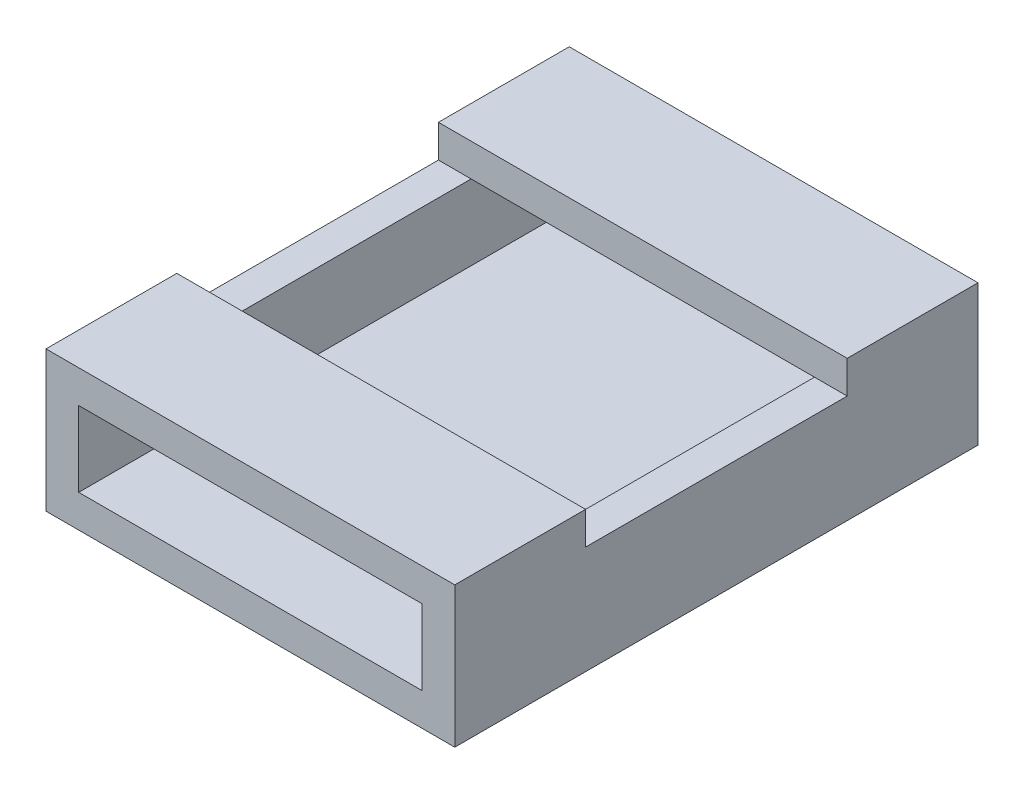
ISO-10303-21;
HEADER;
FILE_DESCRIPTION(('STEP AP214'),'2;1');
FILE_NAME('part.step','',(''),(''),'','','');
FILE_SCHEMA(('AUTOMOTIVE_DESIGN { 1 0 10303 214 1 1 1 1 }'));
ENDSEC;
DATA;
#1=APPLICATION_CONTEXT('core data for automotive mechanical design processes');
#2=APPLICATION_PROTOCOL_DEFINITION('international standard','automotive_design',2000,#1);
#3=PRODUCT_CONTEXT('',#1,'mechanical');
#4=PRODUCT('Part','Part','',(#3));
#5=PRODUCT_RELATED_PRODUCT_CATEGORY('part','',(#4));
#6=PRODUCT_DEFINITION_FORMATION('','',#4);
#7=PRODUCT_DEFINITION_CONTEXT('part definition',#1,'design');
#8=PRODUCT_DEFINITION('design','',#6,#7);
#9=PRODUCT_DEFINITION_SHAPE('','',#8);
#10=(LENGTH_UNIT() NAMED_UNIT(*) SI_UNIT(.MILLI.,.METRE.));
#11=(NAMED_UNIT(*) PLANE_ANGLE_UNIT() SI_UNIT($,.RADIAN.));
#12=(NAMED_UNIT(*) SI_UNIT($,.STERADIAN.) SOLID_ANGLE_UNIT());
#13=UNCERTAINTY_MEASURE_WITH_UNIT(LENGTH_MEASURE(1.E-05),#10,'distance_accuracy_value','');
#14=(GEOMETRIC_REPRESENTATION_CONTEXT(3) GLOBAL_UNCERTAINTY_ASSIGNED_CONTEXT((#13)) GLOBAL_UNIT_ASSIGNED_CONTEXT((#10,
#11,#12)) REPRESENTATION_CONTEXT('',''));
#15=CARTESIAN_POINT('',(0.,0.,0.));
#16=DIRECTION('',(0.,0.,1.));
#17=DIRECTION('',(1.,0.,0.));
#18=AXIS2_PLACEMENT_3D('',#15,#16,#17);
#19=CARTESIAN_POINT('',(0.,3.3,0.));
#20=DIRECTION('',(0.,1.,0.));
#21=DIRECTION('',(0.,0.,1.));
#22=AXIS2_PLACEMENT_3D('',#19,#20,#21);
#23=PLANE('',#22);
#24=DIRECTION('',(0.,0.,1.));
#25=VECTOR('',#24,1.);
#26=CARTESIAN_POINT('',(10.5,3.3,-8.));
#27=LINE('',#26,#25);
#28=CARTESIAN_POINT('',(10.5,3.3,-4.));
#29=VERTEX_POINT('',#28);
#30=CARTESIAN_POINT('',(10.5,3.3,4.));
#31=VERTEX_POINT('',#30);
#32=EDGE_CURVE('E219',#29,#31,#27,.T.);
#33=ORIENTED_EDGE('',*,*,#32,.T.);
#34=DIRECTION('',(-1.,0.,0.));
#35=VECTOR('',#34,1.);
#36=CARTESIAN_POINT('',(-0.999999999999998,3.3,4.));
#37=LINE('',#36,#35);
#38=CARTESIAN_POINT('',(11.5,3.3,4.));
#39=VERTEX_POINT('',#38);
#40=EDGE_CURVE('E168',#39,#31,#37,.T.);
#41=ORIENTED_EDGE('',*,*,#40,.F.);
#42=DIRECTION('',(0.,0.,-1.));
#43=VECTOR('',#42,1.);
#44=CARTESIAN_POINT('',(11.5,3.3,-8.));
#45=LINE('',#44,#43);
#46=CARTESIAN_POINT('',(11.5,3.3,-4.));
#47=VERTEX_POINT('',#46);
#48=EDGE_CURVE('E226',#39,#47,#45,.T.);
#49=ORIENTED_EDGE('',*,*,#48,.T.);
#50=DIRECTION('',(1.,0.,0.));
#51=VECTOR('',#50,1.);
#52=CARTESIAN_POINT('',(-0.999999999999999,3.3,-4.));
#53=LINE('',#52,#51);
#54=EDGE_CURVE('E185',#29,#47,#53,.T.);
#55=ORIENTED_EDGE('',*,*,#54,.F.);
#56=EDGE_LOOP('',(#33,#41,#49,#55));
#57=FACE_BOUND('',#56,.T.);
#58=ADVANCED_FACE('F37',(#57),#23,.T.);
#59=CARTESIAN_POINT('',(0.,3.3,0.));
#60=DIRECTION('',(0.,-1.,0.));
#61=DIRECTION('',(0.,0.,-1.));
#62=AXIS2_PLACEMENT_3D('',#59,#60,#61);
#63=PLANE('',#62);
#64=CARTESIAN_POINT('',(0.,3.3,4.));
#65=VERTEX_POINT('',#64);
#66=CARTESIAN_POINT('',(-0.999999999999999,3.3,4.));
#67=VERTEX_POINT('',#66);
#68=EDGE_CURVE('E62',#65,#67,#37,.T.);
#69=ORIENTED_EDGE('',*,*,#68,.F.);
#70=DIRECTION('',(0.,0.,-1.));
#71=VECTOR('',#70,1.);
#72=CARTESIAN_POINT('',(0.,3.3,-8.));
#73=LINE('',#72,#71);
#74=CARTESIAN_POINT('',(0.,3.3,-4.));
#75=VERTEX_POINT('',#74);
#76=EDGE_CURVE('E215',#65,#75,#73,.T.);
#77=ORIENTED_EDGE('',*,*,#76,.T.);
#78=CARTESIAN_POINT('',(-0.999999999999999,3.3,-4.));
#79=VERTEX_POINT('',#78);
#80=EDGE_CURVE('E199',#79,#75,#53,.T.);
#81=ORIENTED_EDGE('',*,*,#80,.F.);
#82=DIRECTION('',(0.,0.,1.));
#83=VECTOR('',#82,1.);
#84=CARTESIAN_POINT('',(-1.,3.3,-8.));
#85=LINE('',#84,#83);
#86=EDGE_CURVE('E214',#79,#67,#85,.T.);
#87=ORIENTED_EDGE('',*,*,#86,.T.);
#88=EDGE_LOOP('',(#69,#77,#81,#87));
#89=FACE_BOUND('',#88,.T.);
#90=ADVANCED_FACE('F266',(#89),#63,.F.);
#91=CARTESIAN_POINT('',(0.,1.,-8.));
#92=DIRECTION('',(0.,0.,-1.));
#93=DIRECTION('',(-1.,0.,0.));
#94=AXIS2_PLACEMENT_3D('',#91,#92,#93);
#95=PLANE('',#94);
#96=DIRECTION('',(0.,1.,0.));
#97=VECTOR('',#96,1.);
#98=CARTESIAN_POINT('',(10.5,0.,-8.));
#99=LINE('',#98,#97);
#100=CARTESIAN_POINT('',(10.5,1.,-8.));
#101=VERTEX_POINT('',#100);
#102=CARTESIAN_POINT('',(10.5,3.3,-8.));
#103=VERTEX_POINT('',#102);
#104=EDGE_CURVE('E232',#101,#103,#99,.T.);
#105=ORIENTED_EDGE('',*,*,#104,.T.);
#106=DIRECTION('',(-1.,0.,0.));
#107=VECTOR('',#106,1.);
#108=CARTESIAN_POINT('',(-1.,3.3,-8.));
#109=LINE('',#108,#107);
#110=CARTESIAN_POINT('',(0.,3.3,-8.));
#111=VERTEX_POINT('',#110);
#112=EDGE_CURVE('E190',#103,#111,#109,.T.);
#113=ORIENTED_EDGE('',*,*,#112,.T.);
#114=DIRECTION('',(0.,1.,0.));
#115=VECTOR('',#114,1.);
#116=CARTESIAN_POINT('',(0.,0.,-8.));
#117=LINE('',#116,#115);
#118=CARTESIAN_POINT('',(0.,1.,-8.));
#119=VERTEX_POINT('',#118);
#120=EDGE_CURVE('E218',#119,#111,#117,.T.);
#121=ORIENTED_EDGE('',*,*,#120,.F.);
#122=DIRECTION('',(1.,0.,0.));
#123=VECTOR('',#122,1.);
#124=CARTESIAN_POINT('',(0.,1.,-8.));
#125=LINE('',#124,#123);
#126=EDGE_CURVE('E243',#119,#101,#125,.T.);
#127=ORIENTED_EDGE('',*,*,#126,.T.);
#128=EDGE_LOOP('',(#105,#113,#121,#127));
#129=FACE_BOUND('',#128,.T.);
#130=DIRECTION('',(1.,0.,0.));
#131=VECTOR('',#130,1.);
#132=CARTESIAN_POINT('',(0.,0.,-8.));
#133=LINE('',#132,#131);
#134=CARTESIAN_POINT('',(-1.,0.,-8.));
#135=VERTEX_POINT('',#134);
#136=CARTESIAN_POINT('',(11.5,0.,-8.));
#137=VERTEX_POINT('',#136);
#138=EDGE_CURVE('E235',#135,#137,#133,.T.);
#139=ORIENTED_EDGE('',*,*,#138,.F.);
#140=DIRECTION('',(0.,1.,0.));
#141=VECTOR('',#140,1.);
#142=CARTESIAN_POINT('',(-1.,0.,-8.));
#143=LINE('',#142,#141);
#144=CARTESIAN_POINT('',(-1.,4.3,-8.));
#145=VERTEX_POINT('',#144);
#146=EDGE_CURVE('E152',#135,#145,#143,.T.);
#147=ORIENTED_EDGE('',*,*,#146,.T.);
#148=DIRECTION('',(-1.,0.,0.));
#149=VECTOR('',#148,1.);
#150=CARTESIAN_POINT('',(-1.,4.3,-8.));
#151=LINE('',#150,#149);
#152=CARTESIAN_POINT('',(11.5,4.3,-8.));
#153=VERTEX_POINT('',#152);
#154=EDGE_CURVE('E195',#153,#145,#151,.T.);
#155=ORIENTED_EDGE('',*,*,#154,.F.);
#156=DIRECTION('',(0.,1.,0.));
#157=VECTOR('',#156,1.);
#158=CARTESIAN_POINT('',(11.5,0.,-8.));
#159=LINE('',#158,#157);
#160=EDGE_CURVE('E236',#137,#153,#159,.T.);
#161=ORIENTED_EDGE('',*,*,#160,.F.);
#162=EDGE_LOOP('',(#139,#147,#155,#161));
#163=FACE_BOUND('',#162,.T.);
#164=ADVANCED_FACE('F39',(#129,#163),#95,.T.);
#165=CARTESIAN_POINT('',(0.,1.,8.));
#166=DIRECTION('',(0.,0.,-1.));
#167=DIRECTION('',(-1.,0.,0.));
#168=AXIS2_PLACEMENT_3D('',#165,#166,#167);
#169=PLANE('',#168);
#170=DIRECTION('',(0.,1.,0.));
#171=VECTOR('',#170,1.);
#172=CARTESIAN_POINT('',(11.5,0.,8.));
#173=LINE('',#172,#171);
#174=CARTESIAN_POINT('',(11.5,0.,8.));
#175=VERTEX_POINT('',#174);
#176=CARTESIAN_POINT('',(11.5,4.3,8.));
#177=VERTEX_POINT('',#176);
#178=EDGE_CURVE('E159',#175,#177,#173,.T.);
#179=ORIENTED_EDGE('',*,*,#178,.T.);
#180=DIRECTION('',(1.,0.,0.));
#181=VECTOR('',#180,1.);
#182=CARTESIAN_POINT('',(-0.999999999999998,4.3,8.));
#183=LINE('',#182,#181);
#184=CARTESIAN_POINT('',(-0.999999999999998,4.3,8.));
#185=VERTEX_POINT('',#184);
#186=EDGE_CURVE('E155',#185,#177,#183,.T.);
#187=ORIENTED_EDGE('',*,*,#186,.F.);
#188=DIRECTION('',(0.,1.,0.));
#189=VECTOR('',#188,1.);
#190=CARTESIAN_POINT('',(-0.999999999999998,0.,8.));
#191=LINE('',#190,#189);
#192=CARTESIAN_POINT('',(-0.999999999999998,0.,8.));
#193=VERTEX_POINT('',#192);
#194=EDGE_CURVE('E141',#193,#185,#191,.T.);
#195=ORIENTED_EDGE('',*,*,#194,.F.);
#196=DIRECTION('',(1.,0.,0.));
#197=VECTOR('',#196,1.);
#198=CARTESIAN_POINT('',(0.,0.,8.));
#199=LINE('',#198,#197);
#200=EDGE_CURVE('E41',#193,#175,#199,.T.);
#201=ORIENTED_EDGE('',*,*,#200,.T.);
#202=EDGE_LOOP('',(#179,#187,#195,#201));
#203=FACE_BOUND('',#202,.T.);
#204=DIRECTION('',(1.,0.,0.));
#205=VECTOR('',#204,1.);
#206=CARTESIAN_POINT('',(-0.999999999999998,3.3,8.));
#207=LINE('',#206,#205);
#208=CARTESIAN_POINT('',(0.,3.3,8.));
#209=VERTEX_POINT('',#208);
#210=CARTESIAN_POINT('',(10.5,3.3,8.));
#211=VERTEX_POINT('',#210);
#212=EDGE_CURVE('E177',#209,#211,#207,.T.);
#213=ORIENTED_EDGE('',*,*,#212,.T.);
#214=DIRECTION('',(0.,1.,0.));
#215=VECTOR('',#214,1.);
#216=CARTESIAN_POINT('',(10.5,0.,8.));
#217=LINE('',#216,#215);
#218=CARTESIAN_POINT('',(10.5,1.,8.));
#219=VERTEX_POINT('',#218);
#220=EDGE_CURVE('E231',#219,#211,#217,.T.);
#221=ORIENTED_EDGE('',*,*,#220,.F.);
#222=DIRECTION('',(1.,0.,0.));
#223=VECTOR('',#222,1.);
#224=CARTESIAN_POINT('',(0.,1.,8.));
#225=LINE('',#224,#223);
#226=CARTESIAN_POINT('',(0.,1.,8.));
#227=VERTEX_POINT('',#226);
#228=EDGE_CURVE('E11',#227,#219,#225,.T.);
#229=ORIENTED_EDGE('',*,*,#228,.F.);
#230=DIRECTION('',(0.,1.,0.));
#231=VECTOR('',#230,1.);
#232=CARTESIAN_POINT('',(0.,0.,8.));
#233=LINE('',#232,#231);
#234=EDGE_CURVE('E151',#227,#209,#233,.T.);
#235=ORIENTED_EDGE('',*,*,#234,.T.);
#236=EDGE_LOOP('',(#213,#221,#229,#235));
#237=FACE_BOUND('',#236,.T.);
#238=ADVANCED_FACE('F156',(#203,#237),#169,.F.);
#239=CARTESIAN_POINT('',(0.,1.,0.));
#240=DIRECTION('',(0.,1.,0.));
#241=DIRECTION('',(0.,0.,1.));
#242=AXIS2_PLACEMENT_3D('',#239,#240,#241);
#243=PLANE('',#242);
#244=DIRECTION('',(0.,0.,1.));
#245=VECTOR('',#244,1.);
#246=CARTESIAN_POINT('',(10.5,1.,0.));
#247=LINE('',#246,#245);
#248=EDGE_CURVE('E240',#101,#219,#247,.T.);
#249=ORIENTED_EDGE('',*,*,#248,.F.);
#250=ORIENTED_EDGE('',*,*,#126,.F.);
#251=DIRECTION('',(0.,0.,1.));
#252=VECTOR('',#251,1.);
#253=CARTESIAN_POINT('',(0.,1.,0.));
#254=LINE('',#253,#252);
#255=EDGE_CURVE('E46',#119,#227,#254,.T.);
#256=ORIENTED_EDGE('',*,*,#255,.T.);
#257=ORIENTED_EDGE('',*,*,#228,.T.);
#258=EDGE_LOOP('',(#249,#250,#256,#257));
#259=FACE_BOUND('',#258,.T.);
#260=ADVANCED_FACE('F256',(#259),#243,.T.);
#261=CARTESIAN_POINT('',(0.,0.,0.));
#262=DIRECTION('',(0.,1.,0.));
#263=DIRECTION('',(0.,0.,1.));
#264=AXIS2_PLACEMENT_3D('',#261,#262,#263);
#265=PLANE('',#264);
#266=ORIENTED_EDGE('',*,*,#138,.T.);
#267=DIRECTION('',(0.,0.,-1.));
#268=VECTOR('',#267,1.);
#269=CARTESIAN_POINT('',(11.5,0.,-8.));
#270=LINE('',#269,#268);
#271=EDGE_CURVE('E228',#175,#137,#270,.T.);
#272=ORIENTED_EDGE('',*,*,#271,.F.);
#273=ORIENTED_EDGE('',*,*,#200,.F.);
#274=DIRECTION('',(0.,0.,1.));
#275=VECTOR('',#274,1.);
#276=CARTESIAN_POINT('',(-1.,0.,-8.));
#277=LINE('',#276,#275);
#278=EDGE_CURVE('E149',#135,#193,#277,.T.);
#279=ORIENTED_EDGE('',*,*,#278,.F.);
#280=EDGE_LOOP('',(#266,#272,#273,#279));
#281=FACE_BOUND('',#280,.T.);
#282=ADVANCED_FACE('F253',(#281),#265,.F.);
#283=CARTESIAN_POINT('',(10.5,0.,-8.));
#284=DIRECTION('',(-1.,0.,0.));
#285=DIRECTION('',(0.,0.,1.));
#286=AXIS2_PLACEMENT_3D('',#283,#284,#285);
#287=PLANE('',#286);
#288=ORIENTED_EDGE('',*,*,#104,.F.);
#289=ORIENTED_EDGE('',*,*,#248,.T.);
#290=ORIENTED_EDGE('',*,*,#220,.T.);
#291=DIRECTION('',(0.,0.,1.));
#292=VECTOR('',#291,1.);
#293=CARTESIAN_POINT('',(10.5,3.3,-8.));
#294=LINE('',#293,#292);
#295=EDGE_CURVE('E54',#31,#211,#294,.T.);
#296=ORIENTED_EDGE('',*,*,#295,.F.);
#297=ORIENTED_EDGE('',*,*,#32,.F.);
#298=EDGE_CURVE('E223',#103,#29,#27,.T.);
#299=ORIENTED_EDGE('',*,*,#298,.F.);
#300=EDGE_LOOP('',(#288,#289,#290,#296,#297,#299));
#301=FACE_BOUND('',#300,.T.);
#302=ADVANCED_FACE('F255',(#301),#287,.T.);
#303=CARTESIAN_POINT('',(11.5,0.,-8.));
#304=DIRECTION('',(1.,0.,0.));
#305=DIRECTION('',(0.,0.,-1.));
#306=AXIS2_PLACEMENT_3D('',#303,#304,#305);
#307=PLANE('',#306);
#308=ORIENTED_EDGE('',*,*,#160,.T.);
#309=DIRECTION('',(0.,0.,-1.));
#310=VECTOR('',#309,1.);
#311=CARTESIAN_POINT('',(11.5,4.3,-8.));
#312=LINE('',#311,#310);
#313=CARTESIAN_POINT('',(11.5,4.3,-4.));
#314=VERTEX_POINT('',#313);
#315=EDGE_CURVE('E192',#314,#153,#312,.T.);
#316=ORIENTED_EDGE('',*,*,#315,.F.);
#317=DIRECTION('',(0.,-1.,0.));
#318=VECTOR('',#317,1.);
#319=CARTESIAN_POINT('',(11.5,4.3,-4.));
#320=LINE('',#319,#318);
#321=EDGE_CURVE('E198',#314,#47,#320,.T.);
#322=ORIENTED_EDGE('',*,*,#321,.T.);
#323=ORIENTED_EDGE('',*,*,#48,.F.);
#324=DIRECTION('',(0.,-1.,0.));
#325=VECTOR('',#324,1.);
#326=CARTESIAN_POINT('',(11.5,4.3,4.));
#327=LINE('',#326,#325);
#328=CARTESIAN_POINT('',(11.5,4.3,4.));
#329=VERTEX_POINT('',#328);
#330=EDGE_CURVE('E181',#329,#39,#327,.T.);
#331=ORIENTED_EDGE('',*,*,#330,.F.);
#332=DIRECTION('',(0.,0.,-1.));
#333=VECTOR('',#332,1.);
#334=CARTESIAN_POINT('',(11.5,4.3,8.));
#335=LINE('',#334,#333);
#336=EDGE_CURVE('E162',#177,#329,#335,.T.);
#337=ORIENTED_EDGE('',*,*,#336,.F.);
#338=ORIENTED_EDGE('',*,*,#178,.F.);
#339=ORIENTED_EDGE('',*,*,#271,.T.);
#340=EDGE_LOOP('',(#308,#316,#322,#323,#331,#337,#338,#339));
#341=FACE_BOUND('',#340,.T.);
#342=ADVANCED_FACE('F251',(#341),#307,.T.);
#343=CARTESIAN_POINT('',(0.,0.,-8.));
#344=DIRECTION('',(1.,0.,0.));
#345=DIRECTION('',(0.,0.,-1.));
#346=AXIS2_PLACEMENT_3D('',#343,#344,#345);
#347=PLANE('',#346);
#348=ORIENTED_EDGE('',*,*,#255,.F.);
#349=ORIENTED_EDGE('',*,*,#120,.T.);
#350=EDGE_CURVE('E210',#75,#111,#73,.T.);
#351=ORIENTED_EDGE('',*,*,#350,.F.);
#352=ORIENTED_EDGE('',*,*,#76,.F.);
#353=EDGE_CURVE('E211',#209,#65,#73,.T.);
#354=ORIENTED_EDGE('',*,*,#353,.F.);
#355=ORIENTED_EDGE('',*,*,#234,.F.);
#356=EDGE_LOOP('',(#348,#349,#351,#352,#354,#355));
#357=FACE_BOUND('',#356,.T.);
#358=ADVANCED_FACE('F275',(#357),#347,.T.);
#359=CARTESIAN_POINT('',(-1.,0.,-8.));
#360=DIRECTION('',(-1.,0.,0.));
#361=DIRECTION('',(0.,0.,1.));
#362=AXIS2_PLACEMENT_3D('',#359,#360,#361);
#363=PLANE('',#362);
#364=ORIENTED_EDGE('',*,*,#194,.T.);
#365=DIRECTION('',(0.,0.,1.));
#366=VECTOR('',#365,1.);
#367=CARTESIAN_POINT('',(-0.999999999999998,4.3,8.));
#368=LINE('',#367,#366);
#369=CARTESIAN_POINT('',(-0.999999999999998,4.3,4.));
#370=VERTEX_POINT('',#369);
#371=EDGE_CURVE('E146',#370,#185,#368,.T.);
#372=ORIENTED_EDGE('',*,*,#371,.F.);
#373=DIRECTION('',(0.,-1.,0.));
#374=VECTOR('',#373,1.);
#375=CARTESIAN_POINT('',(-0.999999999999998,4.3,4.));
#376=LINE('',#375,#374);
#377=EDGE_CURVE('E176',#370,#67,#376,.T.);
#378=ORIENTED_EDGE('',*,*,#377,.T.);
#379=ORIENTED_EDGE('',*,*,#86,.F.);
#380=DIRECTION('',(0.,-1.,0.));
#381=VECTOR('',#380,1.);
#382=CARTESIAN_POINT('',(-0.999999999999999,4.3,-4.));
#383=LINE('',#382,#381);
#384=CARTESIAN_POINT('',(-0.999999999999999,4.3,-4.));
#385=VERTEX_POINT('',#384);
#386=EDGE_CURVE('E207',#385,#79,#383,.T.);
#387=ORIENTED_EDGE('',*,*,#386,.F.);
#388=DIRECTION('',(0.,0.,1.));
#389=VECTOR('',#388,1.);
#390=CARTESIAN_POINT('',(-1.,4.3,-8.));
#391=LINE('',#390,#389);
#392=EDGE_CURVE('E186',#145,#385,#391,.T.);
#393=ORIENTED_EDGE('',*,*,#392,.F.);
#394=ORIENTED_EDGE('',*,*,#146,.F.);
#395=ORIENTED_EDGE('',*,*,#278,.T.);
#396=EDGE_LOOP('',(#364,#372,#378,#379,#387,#393,#394,#395));
#397=FACE_BOUND('',#396,.T.);
#398=ADVANCED_FACE('F143',(#397),#363,.T.);
#399=CARTESIAN_POINT('',(-0.999999999999999,4.3,-4.));
#400=DIRECTION('',(0.,0.,-1.));
#401=DIRECTION('',(-1.,0.,0.));
#402=AXIS2_PLACEMENT_3D('',#399,#400,#401);
#403=PLANE('',#402);
#404=ORIENTED_EDGE('',*,*,#80,.T.);
#405=EDGE_CURVE('E202',#75,#29,#53,.T.);
#406=ORIENTED_EDGE('',*,*,#405,.T.);
#407=ORIENTED_EDGE('',*,*,#54,.T.);
#408=ORIENTED_EDGE('',*,*,#321,.F.);
#409=DIRECTION('',(1.,0.,0.));
#410=VECTOR('',#409,1.);
#411=CARTESIAN_POINT('',(-0.999999999999999,4.3,-4.));
#412=LINE('',#411,#410);
#413=EDGE_CURVE('E189',#385,#314,#412,.T.);
#414=ORIENTED_EDGE('',*,*,#413,.F.);
#415=ORIENTED_EDGE('',*,*,#386,.T.);
#416=EDGE_LOOP('',(#404,#406,#407,#408,#414,#415));
#417=FACE_BOUND('',#416,.T.);
#418=ADVANCED_FACE('F285',(#417),#403,.F.);
#419=CARTESIAN_POINT('',(0.,4.3,0.));
#420=DIRECTION('',(0.,1.,0.));
#421=DIRECTION('',(0.,0.,1.));
#422=AXIS2_PLACEMENT_3D('',#419,#420,#421);
#423=PLANE('',#422);
#424=ORIENTED_EDGE('',*,*,#392,.T.);
#425=ORIENTED_EDGE('',*,*,#413,.T.);
#426=ORIENTED_EDGE('',*,*,#315,.T.);
#427=ORIENTED_EDGE('',*,*,#154,.T.);
#428=EDGE_LOOP('',(#424,#425,#426,#427));
#429=FACE_BOUND('',#428,.T.);
#430=ADVANCED_FACE('F316',(#429),#423,.T.);
#431=CARTESIAN_POINT('',(0.,3.3,0.));
#432=DIRECTION('',(0.,1.,0.));
#433=DIRECTION('',(0.,0.,1.));
#434=AXIS2_PLACEMENT_3D('',#431,#432,#433);
#435=PLANE('',#434);
#436=ORIENTED_EDGE('',*,*,#298,.T.);
#437=ORIENTED_EDGE('',*,*,#405,.F.);
#438=ORIENTED_EDGE('',*,*,#350,.T.);
#439=ORIENTED_EDGE('',*,*,#112,.F.);
#440=EDGE_LOOP('',(#436,#437,#438,#439));
#441=FACE_BOUND('',#440,.T.);
#442=ADVANCED_FACE('F309',(#441),#435,.F.);
#443=CARTESIAN_POINT('',(-0.999999999999998,4.3,4.));
#444=DIRECTION('',(0.,0.,1.));
#445=DIRECTION('',(1.,0.,0.));
#446=AXIS2_PLACEMENT_3D('',#443,#444,#445);
#447=PLANE('',#446);
#448=ORIENTED_EDGE('',*,*,#40,.T.);
#449=EDGE_CURVE('E171',#31,#65,#37,.T.);
#450=ORIENTED_EDGE('',*,*,#449,.T.);
#451=ORIENTED_EDGE('',*,*,#68,.T.);
#452=ORIENTED_EDGE('',*,*,#377,.F.);
#453=DIRECTION('',(-1.,0.,0.));
#454=VECTOR('',#453,1.);
#455=CARTESIAN_POINT('',(-0.999999999999998,4.3,4.));
#456=LINE('',#455,#454);
#457=EDGE_CURVE('E166',#329,#370,#456,.T.);
#458=ORIENTED_EDGE('',*,*,#457,.F.);
#459=ORIENTED_EDGE('',*,*,#330,.T.);
#460=EDGE_LOOP('',(#448,#450,#451,#452,#458,#459));
#461=FACE_BOUND('',#460,.T.);
#462=ADVANCED_FACE('F304',(#461),#447,.F.);
#463=CARTESIAN_POINT('',(0.,4.3,0.));
#464=DIRECTION('',(0.,-1.,0.));
#465=DIRECTION('',(0.,0.,-1.));
#466=AXIS2_PLACEMENT_3D('',#463,#464,#465);
#467=PLANE('',#466);
#468=ORIENTED_EDGE('',*,*,#371,.T.);
#469=ORIENTED_EDGE('',*,*,#186,.T.);
#470=ORIENTED_EDGE('',*,*,#336,.T.);
#471=ORIENTED_EDGE('',*,*,#457,.T.);
#472=EDGE_LOOP('',(#468,#469,#470,#471));
#473=FACE_BOUND('',#472,.T.);
#474=ADVANCED_FACE('F164',(#473),#467,.F.);
#475=CARTESIAN_POINT('',(0.,3.3,0.));
#476=DIRECTION('',(0.,-1.,0.));
#477=DIRECTION('',(0.,0.,-1.));
#478=AXIS2_PLACEMENT_3D('',#475,#476,#477);
#479=PLANE('',#478);
#480=ORIENTED_EDGE('',*,*,#449,.F.);
#481=ORIENTED_EDGE('',*,*,#295,.T.);
#482=ORIENTED_EDGE('',*,*,#212,.F.);
#483=ORIENTED_EDGE('',*,*,#353,.T.);
#484=EDGE_LOOP('',(#480,#481,#482,#483));
#485=FACE_BOUND('',#484,.T.);
#486=ADVANCED_FACE('F300',(#485),#479,.T.);
#487=CLOSED_SHELL('',(#58,#90,#164,#238,#260,#282,#302,#342,#358,#398,#418,#430,#442,#462,#474,#486));
#488=MANIFOLD_SOLID_BREP('B2',#487);
#489=ADVANCED_BREP_SHAPE_REPRESENTATION('',(#18,#488),#14);
#490=SHAPE_DEFINITION_REPRESENTATION(#9,#489);
ENDSEC;
END-ISO-10303-21;
